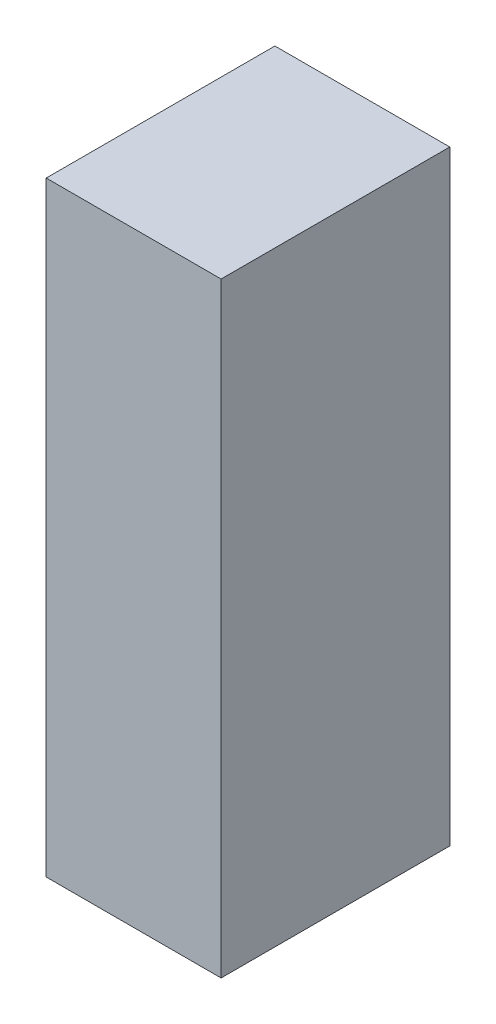
ISO-10303-21;
HEADER;
FILE_DESCRIPTION(('STEP AP214'),'2;1');
FILE_NAME('part.step','',(''),(''),'','','');
FILE_SCHEMA(('AUTOMOTIVE_DESIGN { 1 0 10303 214 1 1 1 1 }'));
ENDSEC;
DATA;
#1=APPLICATION_CONTEXT('core data for automotive mechanical design processes');
#2=APPLICATION_PROTOCOL_DEFINITION('international standard','automotive_design',2000,#1);
#3=PRODUCT_CONTEXT('',#1,'mechanical');
#4=PRODUCT('Part','Part','',(#3));
#5=PRODUCT_RELATED_PRODUCT_CATEGORY('part','',(#4));
#6=PRODUCT_DEFINITION_FORMATION('','',#4);
#7=PRODUCT_DEFINITION_CONTEXT('part definition',#1,'design');
#8=PRODUCT_DEFINITION('design','',#6,#7);
#9=PRODUCT_DEFINITION_SHAPE('','',#8);
#10=(LENGTH_UNIT() NAMED_UNIT(*) SI_UNIT(.MILLI.,.METRE.));
#11=(NAMED_UNIT(*) PLANE_ANGLE_UNIT() SI_UNIT($,.RADIAN.));
#12=(NAMED_UNIT(*) SI_UNIT($,.STERADIAN.) SOLID_ANGLE_UNIT());
#13=UNCERTAINTY_MEASURE_WITH_UNIT(LENGTH_MEASURE(1.E-05),#10,'distance_accuracy_value','');
#14=(GEOMETRIC_REPRESENTATION_CONTEXT(3) GLOBAL_UNCERTAINTY_ASSIGNED_CONTEXT((#13)) GLOBAL_UNIT_ASSIGNED_CONTEXT((#10,
#11,#12)) REPRESENTATION_CONTEXT('',''));
#15=CARTESIAN_POINT('',(0.,0.,0.));
#16=DIRECTION('',(0.,0.,1.));
#17=DIRECTION('',(1.,0.,0.));
#18=AXIS2_PLACEMENT_3D('',#15,#16,#17);
#19=CARTESIAN_POINT('',(6.5,45.,-8.5));
#20=DIRECTION('',(-1.,0.,0.));
#21=DIRECTION('',(0.,0.,1.));
#22=AXIS2_PLACEMENT_3D('',#19,#20,#21);
#23=PLANE('',#22);
#24=DIRECTION('',(0.,0.,-1.));
#25=VECTOR('',#24,1.);
#26=CARTESIAN_POINT('',(6.5,0.,-8.5));
#27=LINE('',#26,#25);
#28=CARTESIAN_POINT('',(6.5,0.,8.5));
#29=VERTEX_POINT('',#28);
#30=CARTESIAN_POINT('',(6.5,0.,-8.5));
#31=VERTEX_POINT('',#30);
#32=EDGE_CURVE('E95',#29,#31,#27,.T.);
#33=ORIENTED_EDGE('',*,*,#32,.T.);
#34=DIRECTION('',(0.,-1.,0.));
#35=VECTOR('',#34,1.);
#36=CARTESIAN_POINT('',(6.5,45.,-8.5));
#37=LINE('',#36,#35);
#38=CARTESIAN_POINT('',(6.5,45.,-8.5));
#39=VERTEX_POINT('',#38);
#40=EDGE_CURVE('E11',#39,#31,#37,.T.);
#41=ORIENTED_EDGE('',*,*,#40,.F.);
#42=DIRECTION('',(0.,0.,-1.));
#43=VECTOR('',#42,1.);
#44=CARTESIAN_POINT('',(6.5,45.,-8.5));
#45=LINE('',#44,#43);
#46=CARTESIAN_POINT('',(6.5,45.,8.5));
#47=VERTEX_POINT('',#46);
#48=EDGE_CURVE('E83',#47,#39,#45,.T.);
#49=ORIENTED_EDGE('',*,*,#48,.F.);
#50=DIRECTION('',(0.,-1.,0.));
#51=VECTOR('',#50,1.);
#52=CARTESIAN_POINT('',(6.5,45.,8.5));
#53=LINE('',#52,#51);
#54=EDGE_CURVE('E91',#47,#29,#53,.T.);
#55=ORIENTED_EDGE('',*,*,#54,.T.);
#56=EDGE_LOOP('',(#33,#41,#49,#55));
#57=FACE_BOUND('',#56,.T.);
#58=ADVANCED_FACE('F32',(#57),#23,.F.);
#59=CARTESIAN_POINT('',(-6.5,45.,-8.5));
#60=DIRECTION('',(0.,0.,1.));
#61=DIRECTION('',(1.,0.,0.));
#62=AXIS2_PLACEMENT_3D('',#59,#60,#61);
#63=PLANE('',#62);
#64=DIRECTION('',(-1.,0.,0.));
#65=VECTOR('',#64,1.);
#66=CARTESIAN_POINT('',(-6.5,0.,-8.5));
#67=LINE('',#66,#65);
#68=CARTESIAN_POINT('',(-6.5,0.,-8.5));
#69=VERTEX_POINT('',#68);
#70=EDGE_CURVE('E87',#31,#69,#67,.T.);
#71=ORIENTED_EDGE('',*,*,#70,.T.);
#72=DIRECTION('',(0.,-1.,0.));
#73=VECTOR('',#72,1.);
#74=CARTESIAN_POINT('',(-6.5,45.,-8.5));
#75=LINE('',#74,#73);
#76=CARTESIAN_POINT('',(-6.5,45.,-8.5));
#77=VERTEX_POINT('',#76);
#78=EDGE_CURVE('E40',#77,#69,#75,.T.);
#79=ORIENTED_EDGE('',*,*,#78,.F.);
#80=DIRECTION('',(-1.,0.,0.));
#81=VECTOR('',#80,1.);
#82=CARTESIAN_POINT('',(-6.5,45.,-8.5));
#83=LINE('',#82,#81);
#84=EDGE_CURVE('E78',#39,#77,#83,.T.);
#85=ORIENTED_EDGE('',*,*,#84,.F.);
#86=ORIENTED_EDGE('',*,*,#40,.T.);
#87=EDGE_LOOP('',(#71,#79,#85,#86));
#88=FACE_BOUND('',#87,.T.);
#89=ADVANCED_FACE('F86',(#88),#63,.F.);
#90=CARTESIAN_POINT('',(-6.5,45.,-8.5));
#91=DIRECTION('',(1.,0.,0.));
#92=DIRECTION('',(0.,0.,-1.));
#93=AXIS2_PLACEMENT_3D('',#90,#91,#92);
#94=PLANE('',#93);
#95=DIRECTION('',(0.,0.,1.));
#96=VECTOR('',#95,1.);
#97=CARTESIAN_POINT('',(-6.5,0.,-8.5));
#98=LINE('',#97,#96);
#99=CARTESIAN_POINT('',(-6.5,0.,8.5));
#100=VERTEX_POINT('',#99);
#101=EDGE_CURVE('E65',#69,#100,#98,.T.);
#102=ORIENTED_EDGE('',*,*,#101,.T.);
#103=DIRECTION('',(0.,-1.,0.));
#104=VECTOR('',#103,1.);
#105=CARTESIAN_POINT('',(-6.5,45.,8.5));
#106=LINE('',#105,#104);
#107=CARTESIAN_POINT('',(-6.5,45.,8.5));
#108=VERTEX_POINT('',#107);
#109=EDGE_CURVE('E88',#108,#100,#106,.T.);
#110=ORIENTED_EDGE('',*,*,#109,.F.);
#111=DIRECTION('',(0.,0.,1.));
#112=VECTOR('',#111,1.);
#113=CARTESIAN_POINT('',(-6.5,45.,-8.5));
#114=LINE('',#113,#112);
#115=EDGE_CURVE('E81',#77,#108,#114,.T.);
#116=ORIENTED_EDGE('',*,*,#115,.F.);
#117=ORIENTED_EDGE('',*,*,#78,.T.);
#118=EDGE_LOOP('',(#102,#110,#116,#117));
#119=FACE_BOUND('',#118,.T.);
#120=ADVANCED_FACE('F89',(#119),#94,.F.);
#121=CARTESIAN_POINT('',(-6.5,45.,8.5));
#122=DIRECTION('',(0.,0.,-1.));
#123=DIRECTION('',(-1.,0.,0.));
#124=AXIS2_PLACEMENT_3D('',#121,#122,#123);
#125=PLANE('',#124);
#126=DIRECTION('',(1.,0.,0.));
#127=VECTOR('',#126,1.);
#128=CARTESIAN_POINT('',(-6.5,0.,8.5));
#129=LINE('',#128,#127);
#130=EDGE_CURVE('E71',#100,#29,#129,.T.);
#131=ORIENTED_EDGE('',*,*,#130,.T.);
#132=ORIENTED_EDGE('',*,*,#54,.F.);
#133=DIRECTION('',(1.,0.,0.));
#134=VECTOR('',#133,1.);
#135=CARTESIAN_POINT('',(-6.5,45.,8.5));
#136=LINE('',#135,#134);
#137=EDGE_CURVE('E48',#108,#47,#136,.T.);
#138=ORIENTED_EDGE('',*,*,#137,.F.);
#139=ORIENTED_EDGE('',*,*,#109,.T.);
#140=EDGE_LOOP('',(#131,#132,#138,#139));
#141=FACE_BOUND('',#140,.T.);
#142=ADVANCED_FACE('F102',(#141),#125,.F.);
#143=CARTESIAN_POINT('',(0.,45.,0.));
#144=DIRECTION('',(0.,1.,0.));
#145=DIRECTION('',(0.,0.,1.));
#146=AXIS2_PLACEMENT_3D('',#143,#144,#145);
#147=PLANE('',#146);
#148=ORIENTED_EDGE('',*,*,#48,.T.);
#149=ORIENTED_EDGE('',*,*,#84,.T.);
#150=ORIENTED_EDGE('',*,*,#115,.T.);
#151=ORIENTED_EDGE('',*,*,#137,.T.);
#152=EDGE_LOOP('',(#148,#149,#150,#151));
#153=FACE_BOUND('',#152,.T.);
#154=ADVANCED_FACE('F79',(#153),#147,.T.);
#155=CARTESIAN_POINT('',(0.,0.,0.));
#156=DIRECTION('',(0.,1.,0.));
#157=DIRECTION('',(0.,0.,1.));
#158=AXIS2_PLACEMENT_3D('',#155,#156,#157);
#159=PLANE('',#158);
#160=ORIENTED_EDGE('',*,*,#32,.F.);
#161=ORIENTED_EDGE('',*,*,#130,.F.);
#162=ORIENTED_EDGE('',*,*,#101,.F.);
#163=ORIENTED_EDGE('',*,*,#70,.F.);
#164=EDGE_LOOP('',(#160,#161,#162,#163));
#165=FACE_BOUND('',#164,.T.);
#166=ADVANCED_FACE('F105',(#165),#159,.F.);
#167=CLOSED_SHELL('',(#58,#89,#120,#142,#154,#166));
#168=MANIFOLD_SOLID_BREP('B2',#167);
#169=ADVANCED_BREP_SHAPE_REPRESENTATION('',(#18,#168),#14);
#170=SHAPE_DEFINITION_REPRESENTATION(#9,#169);
ENDSEC;
END-ISO-10303-21;
